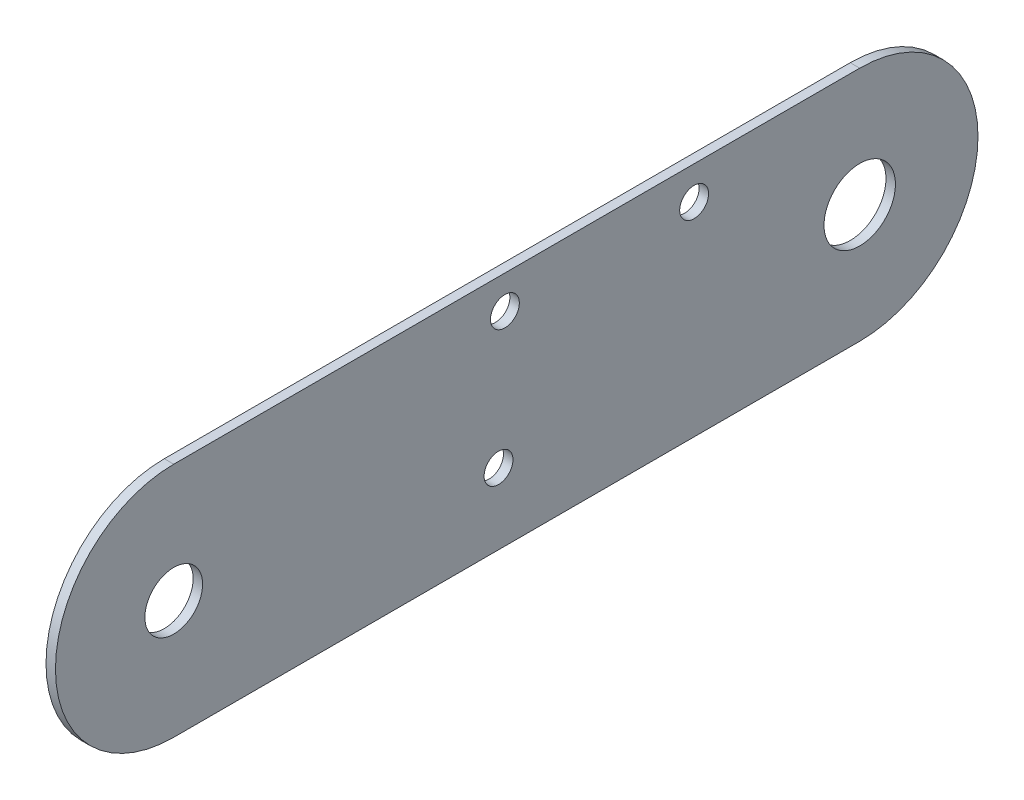
ISO-10303-21;
HEADER;
FILE_DESCRIPTION(('STEP AP214'),'2;1');
FILE_NAME('part.step','',(''),(''),'','','');
FILE_SCHEMA(('AUTOMOTIVE_DESIGN { 1 0 10303 214 1 1 1 1 }'));
ENDSEC;
DATA;
#1=APPLICATION_CONTEXT('core data for automotive mechanical design processes');
#2=APPLICATION_PROTOCOL_DEFINITION('international standard','automotive_design',2000,#1);
#3=PRODUCT_CONTEXT('',#1,'mechanical');
#4=PRODUCT('Part','Part','',(#3));
#5=PRODUCT_RELATED_PRODUCT_CATEGORY('part','',(#4));
#6=PRODUCT_DEFINITION_FORMATION('','',#4);
#7=PRODUCT_DEFINITION_CONTEXT('part definition',#1,'design');
#8=PRODUCT_DEFINITION('design','',#6,#7);
#9=PRODUCT_DEFINITION_SHAPE('','',#8);
#10=(LENGTH_UNIT() NAMED_UNIT(*) SI_UNIT(.MILLI.,.METRE.));
#11=(NAMED_UNIT(*) PLANE_ANGLE_UNIT() SI_UNIT($,.RADIAN.));
#12=(NAMED_UNIT(*) SI_UNIT($,.STERADIAN.) SOLID_ANGLE_UNIT());
#13=UNCERTAINTY_MEASURE_WITH_UNIT(LENGTH_MEASURE(1.E-05),#10,'distance_accuracy_value','');
#14=(GEOMETRIC_REPRESENTATION_CONTEXT(3) GLOBAL_UNCERTAINTY_ASSIGNED_CONTEXT((#13)) GLOBAL_UNIT_ASSIGNED_CONTEXT((#10,
#11,#12)) REPRESENTATION_CONTEXT('',''));
#15=CARTESIAN_POINT('',(0.,0.,0.));
#16=DIRECTION('',(0.,0.,1.));
#17=DIRECTION('',(1.,0.,0.));
#18=AXIS2_PLACEMENT_3D('',#15,#16,#17);
#19=CARTESIAN_POINT('',(2.,-33.6473670974886,125.573683548745));
#20=DIRECTION('',(1.,0.,0.));
#21=DIRECTION('',(0.,0.,-1.));
#22=AXIS2_PLACEMENT_3D('',#19,#20,#21);
#23=PLANE('',#22);
#24=CARTESIAN_POINT('',(2.,-15.6473670974885,15.5736835487447));
#25=DIRECTION('',(1.,0.,0.));
#26=DIRECTION('',(0.,0.,-1.));
#27=AXIS2_PLACEMENT_3D('',#24,#25,#26);
#28=CIRCLE('',#27,3.05);
#29=CARTESIAN_POINT('',(2.,-15.6473670974885,12.5236835487447));
#30=VERTEX_POINT('',#29);
#31=EDGE_CURVE('E127',#30,#30,#28,.T.);
#32=ORIENTED_EDGE('',*,*,#31,.F.);
#33=EDGE_LOOP('',(#32));
#34=FACE_BOUND('',#33,.T.);
#35=CARTESIAN_POINT('',(2.,-33.6473670974886,125.573683548745));
#36=DIRECTION('',(1.,0.,0.));
#37=DIRECTION('',(0.,0.,-1.));
#38=AXIS2_PLACEMENT_3D('',#35,#36,#37);
#39=CIRCLE('',#38,6.10000000000001);
#40=CARTESIAN_POINT('',(2.,-33.6473670974886,119.473683548745));
#41=VERTEX_POINT('',#40);
#42=EDGE_CURVE('E115',#41,#41,#39,.T.);
#43=ORIENTED_EDGE('',*,*,#42,.F.);
#44=EDGE_LOOP('',(#43));
#45=FACE_BOUND('',#44,.T.);
#46=CARTESIAN_POINT('',(2.,-33.6473670974886,125.573683548745));
#47=DIRECTION('',(1.,0.,0.));
#48=DIRECTION('',(0.,0.,-1.));
#49=AXIS2_PLACEMENT_3D('',#46,#47,#48);
#50=CIRCLE('',#49,25.);
#51=CARTESIAN_POINT('',(2.,-8.64736709748853,125.573683548745));
#52=VERTEX_POINT('',#51);
#53=CARTESIAN_POINT('',(2.,-58.6473670974885,125.573683548745));
#54=VERTEX_POINT('',#53);
#55=EDGE_CURVE('E86',#52,#54,#50,.T.);
#56=ORIENTED_EDGE('',*,*,#55,.T.);
#57=DIRECTION('',(0.,0.,-1.));
#58=VECTOR('',#57,1.);
#59=CARTESIAN_POINT('',(2.,-58.6473670974885,-19.4263164512572));
#60=LINE('',#59,#58);
#61=CARTESIAN_POINT('',(2.,-58.6473670974885,-19.4263164512572));
#62=VERTEX_POINT('',#61);
#63=EDGE_CURVE('E80',#54,#62,#60,.T.);
#64=ORIENTED_EDGE('',*,*,#63,.T.);
#65=CARTESIAN_POINT('',(2.,-33.6473670974886,-19.4263164512572));
#66=DIRECTION('',(1.,0.,0.));
#67=DIRECTION('',(0.,0.,-1.));
#68=AXIS2_PLACEMENT_3D('',#65,#66,#67);
#69=CIRCLE('',#68,25.);
#70=CARTESIAN_POINT('',(2.,-8.64736709748856,-19.4263164512572));
#71=VERTEX_POINT('',#70);
#72=EDGE_CURVE('E83',#62,#71,#69,.T.);
#73=ORIENTED_EDGE('',*,*,#72,.T.);
#74=DIRECTION('',(0.,0.,1.));
#75=VECTOR('',#74,1.);
#76=CARTESIAN_POINT('',(2.,-8.64736709748852,-4.9925597215165));
#77=LINE('',#76,#75);
#78=EDGE_CURVE('E52',#71,#52,#77,.T.);
#79=ORIENTED_EDGE('',*,*,#78,.T.);
#80=EDGE_LOOP('',(#56,#64,#73,#79));
#81=FACE_BOUND('',#80,.T.);
#82=CARTESIAN_POINT('',(2.,-33.6473670974886,-19.4263164512572));
#83=DIRECTION('',(1.,0.,0.));
#84=DIRECTION('',(0.,0.,-1.));
#85=AXIS2_PLACEMENT_3D('',#82,#83,#84);
#86=CIRCLE('',#85,7.55000000000005);
#87=CARTESIAN_POINT('',(2.,-33.6473670974886,-26.9763164512572));
#88=VERTEX_POINT('',#87);
#89=EDGE_CURVE('E103',#88,#88,#86,.T.);
#90=ORIENTED_EDGE('',*,*,#89,.F.);
#91=EDGE_LOOP('',(#90));
#92=FACE_BOUND('',#91,.T.);
#93=CARTESIAN_POINT('',(2.,-43.6473670974885,56.9215715352484));
#94=DIRECTION('',(1.,0.,0.));
#95=DIRECTION('',(0.,0.,-1.));
#96=AXIS2_PLACEMENT_3D('',#93,#94,#95);
#97=CIRCLE('',#96,3.05000000000002);
#98=CARTESIAN_POINT('',(2.,-43.6473670974885,53.8715715352484));
#99=VERTEX_POINT('',#98);
#100=EDGE_CURVE('E121',#99,#99,#97,.T.);
#101=ORIENTED_EDGE('',*,*,#100,.F.);
#102=EDGE_LOOP('',(#101));
#103=FACE_BOUND('',#102,.T.);
#104=CARTESIAN_POINT('',(2.,-15.6473670974885,55.5736835487447));
#105=DIRECTION('',(1.,0.,0.));
#106=DIRECTION('',(0.,0.,-1.));
#107=AXIS2_PLACEMENT_3D('',#104,#105,#106);
#108=CIRCLE('',#107,3.05);
#109=CARTESIAN_POINT('',(2.,-15.6473670974885,52.5236835487447));
#110=VERTEX_POINT('',#109);
#111=EDGE_CURVE('E133',#110,#110,#108,.T.);
#112=ORIENTED_EDGE('',*,*,#111,.F.);
#113=EDGE_LOOP('',(#112));
#114=FACE_BOUND('',#113,.T.);
#115=ADVANCED_FACE('F35',(#34,#45,#81,#92,#103,#114),#23,.T.);
#116=CARTESIAN_POINT('',(0.,-33.6473670974886,125.573683548745));
#117=DIRECTION('',(1.,0.,0.));
#118=DIRECTION('',(0.,0.,-1.));
#119=AXIS2_PLACEMENT_3D('',#116,#117,#118);
#120=PLANE('',#119);
#121=CARTESIAN_POINT('',(0.,-33.6473670974886,125.573683548745));
#122=DIRECTION('',(1.,0.,0.));
#123=DIRECTION('',(0.,0.,-1.));
#124=AXIS2_PLACEMENT_3D('',#121,#122,#123);
#125=CIRCLE('',#124,25.);
#126=CARTESIAN_POINT('',(0.,-8.64736709748853,125.573683548745));
#127=VERTEX_POINT('',#126);
#128=CARTESIAN_POINT('',(0.,-58.6473670974885,125.573683548745));
#129=VERTEX_POINT('',#128);
#130=EDGE_CURVE('E100',#127,#129,#125,.T.);
#131=ORIENTED_EDGE('',*,*,#130,.F.);
#132=DIRECTION('',(0.,0.,1.));
#133=VECTOR('',#132,1.);
#134=CARTESIAN_POINT('',(0.,-8.64736709748852,-4.9925597215165));
#135=LINE('',#134,#133);
#136=CARTESIAN_POINT('',(0.,-8.64736709748856,-19.4263164512572));
#137=VERTEX_POINT('',#136);
#138=EDGE_CURVE('E69',#137,#127,#135,.T.);
#139=ORIENTED_EDGE('',*,*,#138,.F.);
#140=CARTESIAN_POINT('',(0.,-33.6473670974886,-19.4263164512572));
#141=DIRECTION('',(1.,0.,0.));
#142=DIRECTION('',(0.,0.,-1.));
#143=AXIS2_PLACEMENT_3D('',#140,#141,#142);
#144=CIRCLE('',#143,25.);
#145=CARTESIAN_POINT('',(0.,-58.6473670974885,-19.4263164512572));
#146=VERTEX_POINT('',#145);
#147=EDGE_CURVE('E105',#146,#137,#144,.T.);
#148=ORIENTED_EDGE('',*,*,#147,.F.);
#149=DIRECTION('',(0.,0.,-1.));
#150=VECTOR('',#149,1.);
#151=CARTESIAN_POINT('',(0.,-58.6473670974885,-19.4263164512572));
#152=LINE('',#151,#150);
#153=EDGE_CURVE('E91',#129,#146,#152,.T.);
#154=ORIENTED_EDGE('',*,*,#153,.F.);
#155=EDGE_LOOP('',(#131,#139,#148,#154));
#156=FACE_BOUND('',#155,.T.);
#157=CARTESIAN_POINT('',(0.,-33.6473670974886,-19.4263164512572));
#158=DIRECTION('',(1.,0.,0.));
#159=DIRECTION('',(0.,0.,-1.));
#160=AXIS2_PLACEMENT_3D('',#157,#158,#159);
#161=CIRCLE('',#160,7.55000000000005);
#162=CARTESIAN_POINT('',(0.,-33.6473670974886,-26.9763164512572));
#163=VERTEX_POINT('',#162);
#164=EDGE_CURVE('E112',#163,#163,#161,.T.);
#165=ORIENTED_EDGE('',*,*,#164,.T.);
#166=EDGE_LOOP('',(#165));
#167=FACE_BOUND('',#166,.T.);
#168=CARTESIAN_POINT('',(0.,-33.6473670974886,125.573683548745));
#169=DIRECTION('',(1.,0.,0.));
#170=DIRECTION('',(0.,0.,-1.));
#171=AXIS2_PLACEMENT_3D('',#168,#169,#170);
#172=CIRCLE('',#171,6.10000000000001);
#173=CARTESIAN_POINT('',(0.,-33.6473670974886,119.473683548745));
#174=VERTEX_POINT('',#173);
#175=EDGE_CURVE('E118',#174,#174,#172,.T.);
#176=ORIENTED_EDGE('',*,*,#175,.T.);
#177=EDGE_LOOP('',(#176));
#178=FACE_BOUND('',#177,.T.);
#179=CARTESIAN_POINT('',(0.,-43.6473670974885,56.9215715352484));
#180=DIRECTION('',(1.,0.,0.));
#181=DIRECTION('',(0.,0.,-1.));
#182=AXIS2_PLACEMENT_3D('',#179,#180,#181);
#183=CIRCLE('',#182,3.05000000000002);
#184=CARTESIAN_POINT('',(0.,-43.6473670974885,53.8715715352484));
#185=VERTEX_POINT('',#184);
#186=EDGE_CURVE('E124',#185,#185,#183,.T.);
#187=ORIENTED_EDGE('',*,*,#186,.T.);
#188=EDGE_LOOP('',(#187));
#189=FACE_BOUND('',#188,.T.);
#190=CARTESIAN_POINT('',(0.,-15.6473670974885,15.5736835487447));
#191=DIRECTION('',(1.,0.,0.));
#192=DIRECTION('',(0.,0.,-1.));
#193=AXIS2_PLACEMENT_3D('',#190,#191,#192);
#194=CIRCLE('',#193,3.05);
#195=CARTESIAN_POINT('',(0.,-15.6473670974885,12.5236835487447));
#196=VERTEX_POINT('',#195);
#197=EDGE_CURVE('E130',#196,#196,#194,.T.);
#198=ORIENTED_EDGE('',*,*,#197,.T.);
#199=EDGE_LOOP('',(#198));
#200=FACE_BOUND('',#199,.T.);
#201=CARTESIAN_POINT('',(0.,-15.6473670974885,55.5736835487447));
#202=DIRECTION('',(1.,0.,0.));
#203=DIRECTION('',(0.,0.,-1.));
#204=AXIS2_PLACEMENT_3D('',#201,#202,#203);
#205=CIRCLE('',#204,3.05);
#206=CARTESIAN_POINT('',(0.,-15.6473670974885,52.5236835487447));
#207=VERTEX_POINT('',#206);
#208=EDGE_CURVE('E136',#207,#207,#205,.T.);
#209=ORIENTED_EDGE('',*,*,#208,.T.);
#210=EDGE_LOOP('',(#209));
#211=FACE_BOUND('',#210,.T.);
#212=ADVANCED_FACE('F146',(#156,#167,#178,#189,#200,#211),#120,.F.);
#213=CARTESIAN_POINT('',(2.,-33.6473670974886,125.573683548745));
#214=DIRECTION('',(-1.,0.,0.));
#215=DIRECTION('',(0.,0.,1.));
#216=AXIS2_PLACEMENT_3D('',#213,#214,#215);
#217=CYLINDRICAL_SURFACE('',#216,25.);
#218=ORIENTED_EDGE('',*,*,#130,.T.);
#219=DIRECTION('',(-1.,0.,0.));
#220=VECTOR('',#219,1.);
#221=CARTESIAN_POINT('',(2.,-58.6473670974885,125.573683548745));
#222=LINE('',#221,#220);
#223=EDGE_CURVE('E11',#54,#129,#222,.T.);
#224=ORIENTED_EDGE('',*,*,#223,.F.);
#225=ORIENTED_EDGE('',*,*,#55,.F.);
#226=DIRECTION('',(-1.,0.,0.));
#227=VECTOR('',#226,1.);
#228=CARTESIAN_POINT('',(2.,-8.64736709748853,125.573683548745));
#229=LINE('',#228,#227);
#230=EDGE_CURVE('E96',#52,#127,#229,.T.);
#231=ORIENTED_EDGE('',*,*,#230,.T.);
#232=EDGE_LOOP('',(#218,#224,#225,#231));
#233=FACE_BOUND('',#232,.T.);
#234=ADVANCED_FACE('F37',(#233),#217,.T.);
#235=CARTESIAN_POINT('',(2.,-58.6473670974885,-19.4263164512572));
#236=DIRECTION('',(0.,1.,0.));
#237=DIRECTION('',(0.,0.,1.));
#238=AXIS2_PLACEMENT_3D('',#235,#236,#237);
#239=PLANE('',#238);
#240=ORIENTED_EDGE('',*,*,#153,.T.);
#241=DIRECTION('',(-1.,0.,0.));
#242=VECTOR('',#241,1.);
#243=CARTESIAN_POINT('',(2.,-58.6473670974885,-19.4263164512572));
#244=LINE('',#243,#242);
#245=EDGE_CURVE('E44',#62,#146,#244,.T.);
#246=ORIENTED_EDGE('',*,*,#245,.F.);
#247=ORIENTED_EDGE('',*,*,#63,.F.);
#248=ORIENTED_EDGE('',*,*,#223,.T.);
#249=EDGE_LOOP('',(#240,#246,#247,#248));
#250=FACE_BOUND('',#249,.T.);
#251=ADVANCED_FACE('F90',(#250),#239,.F.);
#252=CARTESIAN_POINT('',(2.,-33.6473670974886,-19.4263164512572));
#253=DIRECTION('',(-1.,0.,0.));
#254=DIRECTION('',(0.,0.,1.));
#255=AXIS2_PLACEMENT_3D('',#252,#253,#254);
#256=CYLINDRICAL_SURFACE('',#255,25.);
#257=ORIENTED_EDGE('',*,*,#147,.T.);
#258=DIRECTION('',(-1.,0.,0.));
#259=VECTOR('',#258,1.);
#260=CARTESIAN_POINT('',(2.,-8.64736709748856,-19.4263164512572));
#261=LINE('',#260,#259);
#262=EDGE_CURVE('E93',#71,#137,#261,.T.);
#263=ORIENTED_EDGE('',*,*,#262,.F.);
#264=ORIENTED_EDGE('',*,*,#72,.F.);
#265=ORIENTED_EDGE('',*,*,#245,.T.);
#266=EDGE_LOOP('',(#257,#263,#264,#265));
#267=FACE_BOUND('',#266,.T.);
#268=ADVANCED_FACE('F94',(#267),#256,.T.);
#269=CARTESIAN_POINT('',(2.,-8.64736709748852,-4.9925597215165));
#270=DIRECTION('',(0.,-1.,0.));
#271=DIRECTION('',(0.,0.,-1.));
#272=AXIS2_PLACEMENT_3D('',#269,#270,#271);
#273=PLANE('',#272);
#274=ORIENTED_EDGE('',*,*,#138,.T.);
#275=ORIENTED_EDGE('',*,*,#230,.F.);
#276=ORIENTED_EDGE('',*,*,#78,.F.);
#277=ORIENTED_EDGE('',*,*,#262,.T.);
#278=EDGE_LOOP('',(#274,#275,#276,#277));
#279=FACE_BOUND('',#278,.T.);
#280=ADVANCED_FACE('F109',(#279),#273,.F.);
#281=CARTESIAN_POINT('',(2.,-33.6473670974886,-19.4263164512572));
#282=DIRECTION('',(-1.,0.,0.));
#283=DIRECTION('',(0.,0.,1.));
#284=AXIS2_PLACEMENT_3D('',#281,#282,#283);
#285=CYLINDRICAL_SURFACE('',#284,7.55000000000005);
#286=ORIENTED_EDGE('',*,*,#89,.T.);
#287=EDGE_LOOP('',(#286));
#288=FACE_BOUND('',#287,.T.);
#289=ORIENTED_EDGE('',*,*,#164,.F.);
#290=EDGE_LOOP('',(#289));
#291=FACE_BOUND('',#290,.T.);
#292=ADVANCED_FACE('F156',(#288,#291),#285,.F.);
#293=CARTESIAN_POINT('',(2.,-33.6473670974886,125.573683548745));
#294=DIRECTION('',(-1.,0.,0.));
#295=DIRECTION('',(0.,0.,1.));
#296=AXIS2_PLACEMENT_3D('',#293,#294,#295);
#297=CYLINDRICAL_SURFACE('',#296,6.10000000000001);
#298=ORIENTED_EDGE('',*,*,#42,.T.);
#299=EDGE_LOOP('',(#298));
#300=FACE_BOUND('',#299,.T.);
#301=ORIENTED_EDGE('',*,*,#175,.F.);
#302=EDGE_LOOP('',(#301));
#303=FACE_BOUND('',#302,.T.);
#304=ADVANCED_FACE('F205',(#300,#303),#297,.F.);
#305=CARTESIAN_POINT('',(2.,-43.6473670974885,56.9215715352484));
#306=DIRECTION('',(-1.,0.,0.));
#307=DIRECTION('',(0.,0.,1.));
#308=AXIS2_PLACEMENT_3D('',#305,#306,#307);
#309=CYLINDRICAL_SURFACE('',#308,3.05000000000002);
#310=ORIENTED_EDGE('',*,*,#100,.T.);
#311=EDGE_LOOP('',(#310));
#312=FACE_BOUND('',#311,.T.);
#313=ORIENTED_EDGE('',*,*,#186,.F.);
#314=EDGE_LOOP('',(#313));
#315=FACE_BOUND('',#314,.T.);
#316=ADVANCED_FACE('F213',(#312,#315),#309,.F.);
#317=CARTESIAN_POINT('',(2.,-15.6473670974885,15.5736835487447));
#318=DIRECTION('',(-1.,0.,0.));
#319=DIRECTION('',(0.,0.,1.));
#320=AXIS2_PLACEMENT_3D('',#317,#318,#319);
#321=CYLINDRICAL_SURFACE('',#320,3.05);
#322=ORIENTED_EDGE('',*,*,#31,.T.);
#323=EDGE_LOOP('',(#322));
#324=FACE_BOUND('',#323,.T.);
#325=ORIENTED_EDGE('',*,*,#197,.F.);
#326=EDGE_LOOP('',(#325));
#327=FACE_BOUND('',#326,.T.);
#328=ADVANCED_FACE('F221',(#324,#327),#321,.F.);
#329=CARTESIAN_POINT('',(2.,-15.6473670974885,55.5736835487447));
#330=DIRECTION('',(-1.,0.,0.));
#331=DIRECTION('',(0.,0.,1.));
#332=AXIS2_PLACEMENT_3D('',#329,#330,#331);
#333=CYLINDRICAL_SURFACE('',#332,3.05);
#334=ORIENTED_EDGE('',*,*,#111,.T.);
#335=EDGE_LOOP('',(#334));
#336=FACE_BOUND('',#335,.T.);
#337=ORIENTED_EDGE('',*,*,#208,.F.);
#338=EDGE_LOOP('',(#337));
#339=FACE_BOUND('',#338,.T.);
#340=ADVANCED_FACE('F142',(#336,#339),#333,.F.);
#341=CLOSED_SHELL('',(#115,#212,#234,#251,#268,#280,#292,#304,#316,#328,#340));
#342=MANIFOLD_SOLID_BREP('B2',#341);
#343=ADVANCED_BREP_SHAPE_REPRESENTATION('',(#18,#342),#14);
#344=SHAPE_DEFINITION_REPRESENTATION(#9,#343);
ENDSEC;
END-ISO-10303-21;
